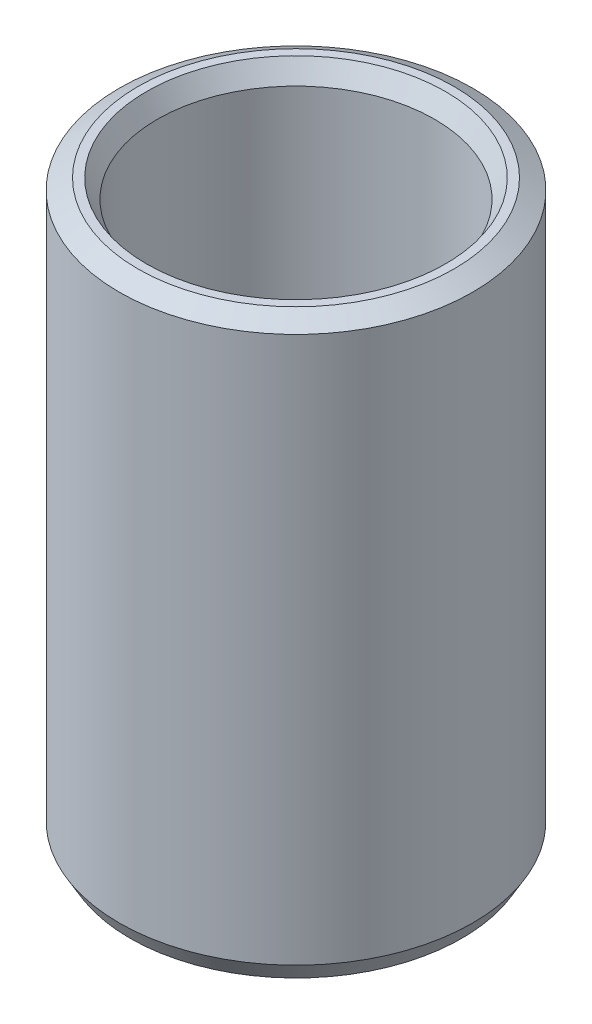
ISO-10303-21;
HEADER;
FILE_DESCRIPTION(('STEP AP214'),'2;1');
FILE_NAME('part.step','',(''),(''),'','','');
FILE_SCHEMA(('AUTOMOTIVE_DESIGN { 1 0 10303 214 1 1 1 1 }'));
ENDSEC;
DATA;
#1=APPLICATION_CONTEXT('core data for automotive mechanical design processes');
#2=APPLICATION_PROTOCOL_DEFINITION('international standard','automotive_design',2000,#1);
#3=PRODUCT_CONTEXT('',#1,'mechanical');
#4=PRODUCT('Part','Part','',(#3));
#5=PRODUCT_RELATED_PRODUCT_CATEGORY('part','',(#4));
#6=PRODUCT_DEFINITION_FORMATION('','',#4);
#7=PRODUCT_DEFINITION_CONTEXT('part definition',#1,'design');
#8=PRODUCT_DEFINITION('design','',#6,#7);
#9=PRODUCT_DEFINITION_SHAPE('','',#8);
#10=(LENGTH_UNIT() NAMED_UNIT(*) SI_UNIT(.MILLI.,.METRE.));
#11=(NAMED_UNIT(*) PLANE_ANGLE_UNIT() SI_UNIT($,.RADIAN.));
#12=(NAMED_UNIT(*) SI_UNIT($,.STERADIAN.) SOLID_ANGLE_UNIT());
#13=UNCERTAINTY_MEASURE_WITH_UNIT(LENGTH_MEASURE(1.E-05),#10,'distance_accuracy_value','');
#14=(GEOMETRIC_REPRESENTATION_CONTEXT(3) GLOBAL_UNCERTAINTY_ASSIGNED_CONTEXT((#13)) GLOBAL_UNIT_ASSIGNED_CONTEXT((#10,
#11,#12)) REPRESENTATION_CONTEXT('',''));
#15=CARTESIAN_POINT('',(0.,0.,0.));
#16=DIRECTION('',(0.,0.,1.));
#17=DIRECTION('',(1.,0.,0.));
#18=AXIS2_PLACEMENT_3D('',#15,#16,#17);
#19=CARTESIAN_POINT('',(0.,146.611225133491,0.));
#20=DIRECTION('',(0.,-1.,0.));
#21=DIRECTION('',(0.,0.,-1.));
#22=AXIS2_PLACEMENT_3D('',#19,#20,#21);
#23=CYLINDRICAL_SURFACE('',#22,45.);
#24=CARTESIAN_POINT('',(0.,4.75385572121043,0.));
#25=DIRECTION('',(0.,1.,0.));
#26=DIRECTION('',(0.,0.,1.));
#27=AXIS2_PLACEMENT_3D('',#24,#25,#26);
#28=CIRCLE('',#27,45.);
#29=CARTESIAN_POINT('',(0.,4.75385572121043,45.));
#30=VERTEX_POINT('',#29);
#31=EDGE_CURVE('E10',#30,#30,#28,.T.);
#32=ORIENTED_EDGE('',*,*,#31,.T.);
#33=EDGE_LOOP('',(#32));
#34=FACE_BOUND('',#33,.T.);
#35=CARTESIAN_POINT('',(0.,143.866585253162,0.));
#36=DIRECTION('',(0.,1.,0.));
#37=DIRECTION('',(0.,0.,1.));
#38=AXIS2_PLACEMENT_3D('',#35,#36,#37);
#39=CIRCLE('',#38,45.);
#40=CARTESIAN_POINT('',(0.,143.866585253162,-45.));
#41=VERTEX_POINT('',#40);
#42=EDGE_CURVE('E50',#41,#41,#39,.F.);
#43=ORIENTED_EDGE('',*,*,#42,.T.);
#44=EDGE_LOOP('',(#43));
#45=FACE_BOUND('',#44,.T.);
#46=ADVANCED_FACE('F39',(#34,#45),#23,.T.);
#47=CARTESIAN_POINT('',(0.,146.611225133491,0.));
#48=DIRECTION('',(0.,1.,0.));
#49=DIRECTION('',(0.,0.,1.));
#50=AXIS2_PLACEMENT_3D('',#47,#48,#49);
#51=PLANE('',#50);
#52=CARTESIAN_POINT('',(0.,146.611225133491,0.));
#53=DIRECTION('',(0.,1.,0.));
#54=DIRECTION('',(0.,0.,1.));
#55=AXIS2_PLACEMENT_3D('',#52,#53,#54);
#56=CIRCLE('',#55,38.0495822564959);
#57=CARTESIAN_POINT('',(0.,146.611225133491,38.0495822564959));
#58=VERTEX_POINT('',#57);
#59=EDGE_CURVE('E58',#58,#58,#56,.F.);
#60=ORIENTED_EDGE('',*,*,#59,.T.);
#61=EDGE_LOOP('',(#60));
#62=FACE_BOUND('',#61,.T.);
#63=CARTESIAN_POINT('',(0.,146.611225133491,0.));
#64=DIRECTION('',(0.,1.,0.));
#65=DIRECTION('',(0.,0.,1.));
#66=AXIS2_PLACEMENT_3D('',#63,#64,#65);
#67=CIRCLE('',#66,40.2461442787896);
#68=CARTESIAN_POINT('',(0.,146.611225133491,-40.2461442787896));
#69=VERTEX_POINT('',#68);
#70=EDGE_CURVE('E61',#69,#69,#67,.T.);
#71=ORIENTED_EDGE('',*,*,#70,.T.);
#72=EDGE_LOOP('',(#71));
#73=FACE_BOUND('',#72,.T.);
#74=ADVANCED_FACE('F88',(#62,#73),#51,.T.);
#75=CARTESIAN_POINT('',(0.,0.,0.));
#76=DIRECTION('',(0.,1.,0.));
#77=DIRECTION('',(0.,0.,1.));
#78=AXIS2_PLACEMENT_3D('',#75,#76,#77);
#79=PLANE('',#78);
#80=CARTESIAN_POINT('',(0.,0.,0.));
#81=DIRECTION('',(0.,1.,0.));
#82=DIRECTION('',(0.,0.,1.));
#83=AXIS2_PLACEMENT_3D('',#80,#81,#82);
#84=CIRCLE('',#83,40.0587980973769);
#85=CARTESIAN_POINT('',(0.,0.,-40.0587980973769));
#86=VERTEX_POINT('',#85);
#87=EDGE_CURVE('E51',#86,#86,#84,.T.);
#88=ORIENTED_EDGE('',*,*,#87,.T.);
#89=EDGE_LOOP('',(#88));
#90=FACE_BOUND('',#89,.T.);
#91=CARTESIAN_POINT('',(0.,0.,0.));
#92=DIRECTION('',(0.,1.,0.));
#93=DIRECTION('',(0.,0.,1.));
#94=AXIS2_PLACEMENT_3D('',#91,#92,#93);
#95=CIRCLE('',#94,42.2553601196705);
#96=CARTESIAN_POINT('',(0.,0.,42.2553601196705));
#97=VERTEX_POINT('',#96);
#98=EDGE_CURVE('E54',#97,#97,#95,.F.);
#99=ORIENTED_EDGE('',*,*,#98,.T.);
#100=EDGE_LOOP('',(#99));
#101=FACE_BOUND('',#100,.T.);
#102=ADVANCED_FACE('F83',(#90,#101),#79,.F.);
#103=CARTESIAN_POINT('',(0.,146.611225133491,0.));
#104=DIRECTION('',(0.,-1.,0.));
#105=DIRECTION('',(0.,0.,-1.));
#106=AXIS2_PLACEMENT_3D('',#103,#104,#105);
#107=CYLINDRICAL_SURFACE('',#106,35.3049423761664);
#108=CARTESIAN_POINT('',(0.,141.857369412281,0.));
#109=DIRECTION('',(0.,1.,0.));
#110=DIRECTION('',(0.,0.,1.));
#111=AXIS2_PLACEMENT_3D('',#108,#109,#110);
#112=CIRCLE('',#111,35.3049423761664);
#113=CARTESIAN_POINT('',(0.,141.857369412281,35.3049423761664));
#114=VERTEX_POINT('',#113);
#115=EDGE_CURVE('E67',#114,#114,#112,.T.);
#116=ORIENTED_EDGE('',*,*,#115,.T.);
#117=EDGE_LOOP('',(#116));
#118=FACE_BOUND('',#117,.T.);
#119=CARTESIAN_POINT('',(0.,2.74463988032955,0.));
#120=DIRECTION('',(0.,1.,0.));
#121=DIRECTION('',(0.,0.,1.));
#122=AXIS2_PLACEMENT_3D('',#119,#120,#121);
#123=CIRCLE('',#122,35.3049423761664);
#124=CARTESIAN_POINT('',(0.,2.74463988032955,-35.3049423761664));
#125=VERTEX_POINT('',#124);
#126=EDGE_CURVE('E69',#125,#125,#123,.F.);
#127=ORIENTED_EDGE('',*,*,#126,.T.);
#128=EDGE_LOOP('',(#127));
#129=FACE_BOUND('',#128,.T.);
#130=ADVANCED_FACE('F71',(#118,#129),#107,.F.);
#131=CARTESIAN_POINT('',(0.,141.857369412281,0.));
#132=DIRECTION('',(0.,1.,0.));
#133=DIRECTION('',(0.,0.,1.));
#134=AXIS2_PLACEMENT_3D('',#131,#132,#133);
#135=CONICAL_SURFACE('',#134,35.3049423761664,0.523598775598299);
#136=ORIENTED_EDGE('',*,*,#59,.F.);
#137=EDGE_LOOP('',(#136));
#138=FACE_BOUND('',#137,.T.);
#139=ORIENTED_EDGE('',*,*,#115,.F.);
#140=EDGE_LOOP('',(#139));
#141=FACE_BOUND('',#140,.T.);
#142=ADVANCED_FACE('F77',(#138,#141),#135,.F.);
#143=CARTESIAN_POINT('',(0.,0.,0.));
#144=DIRECTION('',(0.,-1.,0.));
#145=DIRECTION('',(0.,0.,-1.));
#146=AXIS2_PLACEMENT_3D('',#143,#144,#145);
#147=CONICAL_SURFACE('',#146,40.0587980973769,1.04719755119659);
#148=CARTESIAN_POINT('',(0.,2.74463988032955,-35.3049423761664));
#149=CARTESIAN_POINT('',(0.,2.71604988157612,-35.3544617065957));
#150=CARTESIAN_POINT('',(0.,2.68745988282269,-35.4039810370249));
#151=CARTESIAN_POINT('',(0.,2.63027988531582,-35.5030196978835));
#152=CARTESIAN_POINT('',(0.,2.60168988656239,-35.5525390283128));
#153=CARTESIAN_POINT('',(0.,2.54450988905552,-35.6515776891713));
#154=CARTESIAN_POINT('',(0.,2.51591989030209,-35.7010970196006));
#155=CARTESIAN_POINT('',(0.,2.45873989279522,-35.8001356804591));
#156=CARTESIAN_POINT('',(0.,2.43014989404179,-35.8496550108884));
#157=CARTESIAN_POINT('',(0.,2.37296989653493,-35.948693671747));
#158=CARTESIAN_POINT('',(0.,2.34437989778149,-35.9982130021762));
#159=CARTESIAN_POINT('',(0.,2.28719990027463,-36.0972516630348));
#160=CARTESIAN_POINT('',(0.,2.25860990152119,-36.1467709934641));
#161=CARTESIAN_POINT('',(0.,2.20142990401433,-36.2458096543226));
#162=CARTESIAN_POINT('',(0.,2.1728399052609,-36.2953289847519));
#163=CARTESIAN_POINT('',(0.,2.11565990775403,-36.3943676456104));
#164=CARTESIAN_POINT('',(0.,2.0870699090006,-36.4438869760397));
#165=CARTESIAN_POINT('',(0.,2.02988991149373,-36.5429256368983));
#166=CARTESIAN_POINT('',(0.,2.0012999127403,-36.5924449673275));
#167=CARTESIAN_POINT('',(0.,1.94411991523343,-36.6914836281861));
#168=CARTESIAN_POINT('',(0.,1.91552991648,-36.7410029586154));
#169=CARTESIAN_POINT('',(0.,1.85834991897313,-36.8400416194739));
#170=CARTESIAN_POINT('',(0.,1.8297599202197,-36.8895609499032));
#171=CARTESIAN_POINT('',(0.,1.77257992271283,-36.9885996107618));
#172=CARTESIAN_POINT('',(0.,1.7439899239594,-37.038118941191));
#173=CARTESIAN_POINT('',(0.,1.68680992645254,-37.1371576020496));
#174=CARTESIAN_POINT('',(0.,1.65821992769911,-37.1866769324789));
#175=CARTESIAN_POINT('',(0.,1.60103993019224,-37.2857155933374));
#176=CARTESIAN_POINT('',(0.,1.57244993143881,-37.3352349237667));
#177=CARTESIAN_POINT('',(0.,1.51526993393194,-37.4342735846252));
#178=CARTESIAN_POINT('',(0.,1.48667993517851,-37.4837929150545));
#179=CARTESIAN_POINT('',(0.,1.42949993767164,-37.5828315759131));
#180=CARTESIAN_POINT('',(0.,1.40090993891821,-37.6323509063423));
#181=CARTESIAN_POINT('',(0.,1.34372994141134,-37.7313895672009));
#182=CARTESIAN_POINT('',(0.,1.31513994265791,-37.7809088976302));
#183=CARTESIAN_POINT('',(0.,1.25795994515104,-37.8799475584887));
#184=CARTESIAN_POINT('',(0.,1.22936994639761,-37.929466888918));
#185=CARTESIAN_POINT('',(0.,1.17218994889075,-38.0285055497765));
#186=CARTESIAN_POINT('',(0.,1.14359995013731,-38.0780248802058));
#187=CARTESIAN_POINT('',(0.,1.08641995263045,-38.1770635410644));
#188=CARTESIAN_POINT('',(0.,1.05782995387701,-38.2265828714936));
#189=CARTESIAN_POINT('',(0.,1.00064995637015,-38.3256215323522));
#190=CARTESIAN_POINT('',(0.,0.972059957616717,-38.3751408627815));
#191=CARTESIAN_POINT('',(0.,0.914879960109851,-38.47417952364));
#192=CARTESIAN_POINT('',(0.,0.886289961356417,-38.5236988540693));
#193=CARTESIAN_POINT('',(0.,0.829109963849551,-38.6227375149279));
#194=CARTESIAN_POINT('',(0.,0.800519965096119,-38.6722568453571));
#195=CARTESIAN_POINT('',(0.,0.743339967589254,-38.7712955062157));
#196=CARTESIAN_POINT('',(0.,0.714749968835822,-38.820814836645));
#197=CARTESIAN_POINT('',(0.,0.657569971328956,-38.9198534975035));
#198=CARTESIAN_POINT('',(0.,0.628979972575522,-38.9693728279328));
#199=CARTESIAN_POINT('',(0.,0.571799975068656,-39.0684114887913));
#200=CARTESIAN_POINT('',(0.,0.543209976315223,-39.1179308192206));
#201=CARTESIAN_POINT('',(0.,0.486029978808359,-39.2169694800792));
#202=CARTESIAN_POINT('',(0.,0.457439980054926,-39.2664888105084));
#203=CARTESIAN_POINT('',(0.,0.40025998254806,-39.365527471367));
#204=CARTESIAN_POINT('',(0.,0.371669983794626,-39.4150468017963));
#205=CARTESIAN_POINT('',(0.,0.31448998628776,-39.5140854626548));
#206=CARTESIAN_POINT('',(0.,0.285899987534328,-39.5636047930841));
#207=CARTESIAN_POINT('',(0.,0.228719990027463,-39.6626434539427));
#208=CARTESIAN_POINT('',(0.,0.20012999127403,-39.7121627843719));
#209=CARTESIAN_POINT('',(0.,0.142949993767165,-39.8112014452305));
#210=CARTESIAN_POINT('',(0.,0.114359995013731,-39.8607207756598));
#211=CARTESIAN_POINT('',(0.,0.0571799975068647,-39.9597594365183));
#212=CARTESIAN_POINT('',(0.,0.0285899987534314,-40.0092787669476));
#213=CARTESIAN_POINT('',(0.,0.,-40.0587980973769));
#214=B_SPLINE_CURVE_WITH_KNOTS('',3,(#148,#149,#150,#151,#152,#153,#154,#155,#156,#157,#158,
#159,#160,#161,#162,#163,#164,#165,#166,#167,#168,#169,#170,#171,#172,#173,#174,#175,#176,#177,
#178,#179,#180,#181,#182,#183,#184,#185,#186,#187,#188,#189,#190,#191,#192,#193,#194,#195,#196,
#197,#198,#199,#200,#201,#202,#203,#204,#205,#206,#207,#208,#209,#210,#211,#212,#213),
.UNSPECIFIED.,.F.,.F.,(4,2,2,2,2,2,2,2,2,2,2,2,2,2,2,2,2,2,2,2,2,2,2,2,2,2,2,2,2,2,2,2,4),(0.,
0.171539992520597,0.343079985041189,0.514619977561786,0.686159970082384,0.857699962602975,
1.02923995512357,1.20077994764417,1.37231994016476,1.54385993268536,1.71539992520596,
1.88693991772655,2.05847991024715,2.23001990276774,2.40155989528833,2.57309988780893,
2.74463988032953,2.91617987285012,3.08771986537072,3.25925985789131,3.43079985041191,
3.6023398429325,3.7738798354531,3.94541982797369,4.11695982049429,4.28849981301488,
4.46003980553548,4.63157979805608,4.80311979057667,4.97465978309727,5.14619977561787,
5.31773976813846,5.48927976065906),.UNSPECIFIED.);
#215=EDGE_CURVE('BSEAM73',#125,#86,#214,.T.);
#216=ORIENTED_EDGE('',*,*,#126,.F.);
#217=ORIENTED_EDGE('',*,*,#87,.F.);
#218=ORIENTED_EDGE('',*,*,#215,.T.);
#219=ORIENTED_EDGE('',*,*,#215,.F.);
#220=EDGE_LOOP('',(#216,#218,#217,#219));
#221=FACE_BOUND('',#220,.T.);
#222=ADVANCED_FACE('F73',(#221),#147,.F.);
#223=CARTESIAN_POINT('',(0.,4.75385572121043,0.));
#224=DIRECTION('',(0.,1.,0.));
#225=DIRECTION('',(0.,0.,1.));
#226=AXIS2_PLACEMENT_3D('',#223,#224,#225);
#227=CONICAL_SURFACE('',#226,45.,0.523598775598301);
#228=ORIENTED_EDGE('',*,*,#98,.F.);
#229=EDGE_LOOP('',(#228));
#230=FACE_BOUND('',#229,.T.);
#231=ORIENTED_EDGE('',*,*,#31,.F.);
#232=EDGE_LOOP('',(#231));
#233=FACE_BOUND('',#232,.T.);
#234=ADVANCED_FACE('F76',(#230,#233),#227,.T.);
#235=CARTESIAN_POINT('',(0.,146.611225133491,0.));
#236=DIRECTION('',(0.,-1.,0.));
#237=DIRECTION('',(0.,0.,-1.));
#238=AXIS2_PLACEMENT_3D('',#235,#236,#237);
#239=CONICAL_SURFACE('',#238,40.2461442787896,1.04719755119659);
#240=CARTESIAN_POINT('',(0.,143.866585253162,-45.));
#241=CARTESIAN_POINT('',(0.,143.895175251915,-44.9504806695708));
#242=CARTESIAN_POINT('',(0.,143.923765250669,-44.9009613391415));
#243=CARTESIAN_POINT('',(0.,143.980945248175,-44.8019226782829));
#244=CARTESIAN_POINT('',(0.,144.009535246929,-44.7524033478537));
#245=CARTESIAN_POINT('',(0.,144.066715244436,-44.6533646869951));
#246=CARTESIAN_POINT('',(0.,144.095305243189,-44.6038453565658));
#247=CARTESIAN_POINT('',(0.,144.152485240696,-44.5048066957073));
#248=CARTESIAN_POINT('',(0.,144.181075239449,-44.455287365278));
#249=CARTESIAN_POINT('',(0.,144.238255236956,-44.3562487044195));
#250=CARTESIAN_POINT('',(0.,144.26684523571,-44.3067293739902));
#251=CARTESIAN_POINT('',(0.,144.324025233217,-44.2076907131316));
#252=CARTESIAN_POINT('',(0.,144.35261523197,-44.1581713827023));
#253=CARTESIAN_POINT('',(0.,144.409795229477,-44.0591327218438));
#254=CARTESIAN_POINT('',(0.,144.43838522823,-44.0096133914145));
#255=CARTESIAN_POINT('',(0.,144.495565225737,-43.910574730556));
#256=CARTESIAN_POINT('',(0.,144.524155224491,-43.8610554001267));
#257=CARTESIAN_POINT('',(0.,144.581335221998,-43.7620167392681));
#258=CARTESIAN_POINT('',(0.,144.609925220751,-43.7124974088389));
#259=CARTESIAN_POINT('',(0.,144.667105218258,-43.6134587479803));
#260=CARTESIAN_POINT('',(0.,144.695695217011,-43.563939417551));
#261=CARTESIAN_POINT('',(0.,144.752875214518,-43.4649007566925));
#262=CARTESIAN_POINT('',(0.,144.781465213272,-43.4153814262632));
#263=CARTESIAN_POINT('',(0.,144.838645210778,-43.3163427654047));
#264=CARTESIAN_POINT('',(0.,144.867235209532,-43.2668234349754));
#265=CARTESIAN_POINT('',(0.,144.924415207039,-43.1677847741168));
#266=CARTESIAN_POINT('',(0.,144.953005205792,-43.1182654436876));
#267=CARTESIAN_POINT('',(0.,145.010185203299,-43.019226782829));
#268=CARTESIAN_POINT('',(0.,145.038775202052,-42.9697074523997));
#269=CARTESIAN_POINT('',(0.,145.095955199559,-42.8706687915412));
#270=CARTESIAN_POINT('',(0.,145.124545198313,-42.8211494611119));
#271=CARTESIAN_POINT('',(0.,145.18172519582,-42.7221108002534));
#272=CARTESIAN_POINT('',(0.,145.210315194573,-42.6725914698241));
#273=CARTESIAN_POINT('',(0.,145.26749519208,-42.5735528089655));
#274=CARTESIAN_POINT('',(0.,145.296085190833,-42.5240334785363));
#275=CARTESIAN_POINT('',(0.,145.35326518834,-42.4249948176777));
#276=CARTESIAN_POINT('',(0.,145.381855187094,-42.3754754872484));
#277=CARTESIAN_POINT('',(0.,145.4390351846,-42.2764368263899));
#278=CARTESIAN_POINT('',(0.,145.467625183354,-42.2269174959606));
#279=CARTESIAN_POINT('',(0.,145.524805180861,-42.1278788351021));
#280=CARTESIAN_POINT('',(0.,145.553395179614,-42.0783595046728));
#281=CARTESIAN_POINT('',(0.,145.610575177121,-41.9793208438142));
#282=CARTESIAN_POINT('',(0.,145.639165175875,-41.929801513385));
#283=CARTESIAN_POINT('',(0.,145.696345173381,-41.8307628525264));
#284=CARTESIAN_POINT('',(0.,145.724935172135,-41.7812435220971));
#285=CARTESIAN_POINT('',(0.,145.782115169642,-41.6822048612386));
#286=CARTESIAN_POINT('',(0.,145.810705168395,-41.6326855308093));
#287=CARTESIAN_POINT('',(0.,145.867885165902,-41.5336468699507));
#288=CARTESIAN_POINT('',(0.,145.896475164655,-41.4841275395215));
#289=CARTESIAN_POINT('',(0.,145.953655162162,-41.3850888786629));
#290=CARTESIAN_POINT('',(0.,145.982245160916,-41.3355695482336));
#291=CARTESIAN_POINT('',(0.,146.039425158423,-41.2365308873751));
#292=CARTESIAN_POINT('',(0.,146.068015157176,-41.1870115569458));
#293=CARTESIAN_POINT('',(0.,146.125195154683,-41.0879728960873));
#294=CARTESIAN_POINT('',(0.,146.153785153436,-41.038453565658));
#295=CARTESIAN_POINT('',(0.,146.210965150943,-40.9394149047994));
#296=CARTESIAN_POINT('',(0.,146.239555149697,-40.8898955743702));
#297=CARTESIAN_POINT('',(0.,146.296735147203,-40.7908569135116));
#298=CARTESIAN_POINT('',(0.,146.325325145957,-40.7413375830823));
#299=CARTESIAN_POINT('',(0.,146.382505143464,-40.6422989222238));
#300=CARTESIAN_POINT('',(0.,146.411095142217,-40.5927795917945));
#301=CARTESIAN_POINT('',(0.,146.468275139724,-40.493740930936));
#302=CARTESIAN_POINT('',(0.,146.496865138478,-40.4442216005067));
#303=CARTESIAN_POINT('',(0.,146.554045135984,-40.3451829396481));
#304=CARTESIAN_POINT('',(0.,146.582635134738,-40.2956636092189));
#305=CARTESIAN_POINT('',(0.,146.611225133491,-40.2461442787896));
#306=B_SPLINE_CURVE_WITH_KNOTS('',3,(#240,#241,#242,#243,#244,#245,#246,#247,#248,#249,#250,
#251,#252,#253,#254,#255,#256,#257,#258,#259,#260,#261,#262,#263,#264,#265,#266,#267,#268,#269,
#270,#271,#272,#273,#274,#275,#276,#277,#278,#279,#280,#281,#282,#283,#284,#285,#286,#287,#288,
#289,#290,#291,#292,#293,#294,#295,#296,#297,#298,#299,#300,#301,#302,#303,#304,#305),
.UNSPECIFIED.,.F.,.F.,(4,2,2,2,2,2,2,2,2,2,2,2,2,2,2,2,2,2,2,2,2,2,2,2,2,2,2,2,2,2,2,2,4),(0.,
0.171539992520603,0.3430799850412,0.514619977561789,0.686159970082387,0.857699962602976,
1.02923995512357,1.20077994764418,1.37231994016476,1.54385993268536,1.71539992520595,
1.88693991772655,2.05847991024715,2.23001990276773,2.40155989528833,2.57309988780891,
2.74463988032952,2.91617987285012,3.0877198653707,3.2592598578913,3.43079985041189,
3.60233984293249,3.77387983545309,3.94541982797367,4.11695982049428,4.28849981301486,
4.46003980553546,4.63157979805606,4.80311979057665,4.97465978309725,5.14619977561784,
5.31773976813843,5.48927976065904),.UNSPECIFIED.);
#307=EDGE_CURVE('BSEAM45',#41,#69,#306,.T.);
#308=ORIENTED_EDGE('',*,*,#42,.F.);
#309=ORIENTED_EDGE('',*,*,#70,.F.);
#310=ORIENTED_EDGE('',*,*,#307,.T.);
#311=ORIENTED_EDGE('',*,*,#307,.F.);
#312=EDGE_LOOP('',(#308,#310,#309,#311));
#313=FACE_BOUND('',#312,.T.);
#314=ADVANCED_FACE('F45',(#313),#239,.T.);
#315=CLOSED_SHELL('',(#46,#74,#102,#130,#142,#222,#234,#314));
#316=MANIFOLD_SOLID_BREP('B2',#315);
#317=ADVANCED_BREP_SHAPE_REPRESENTATION('',(#18,#316),#14);
#318=SHAPE_DEFINITION_REPRESENTATION(#9,#317);
ENDSEC;
END-ISO-10303-21;
